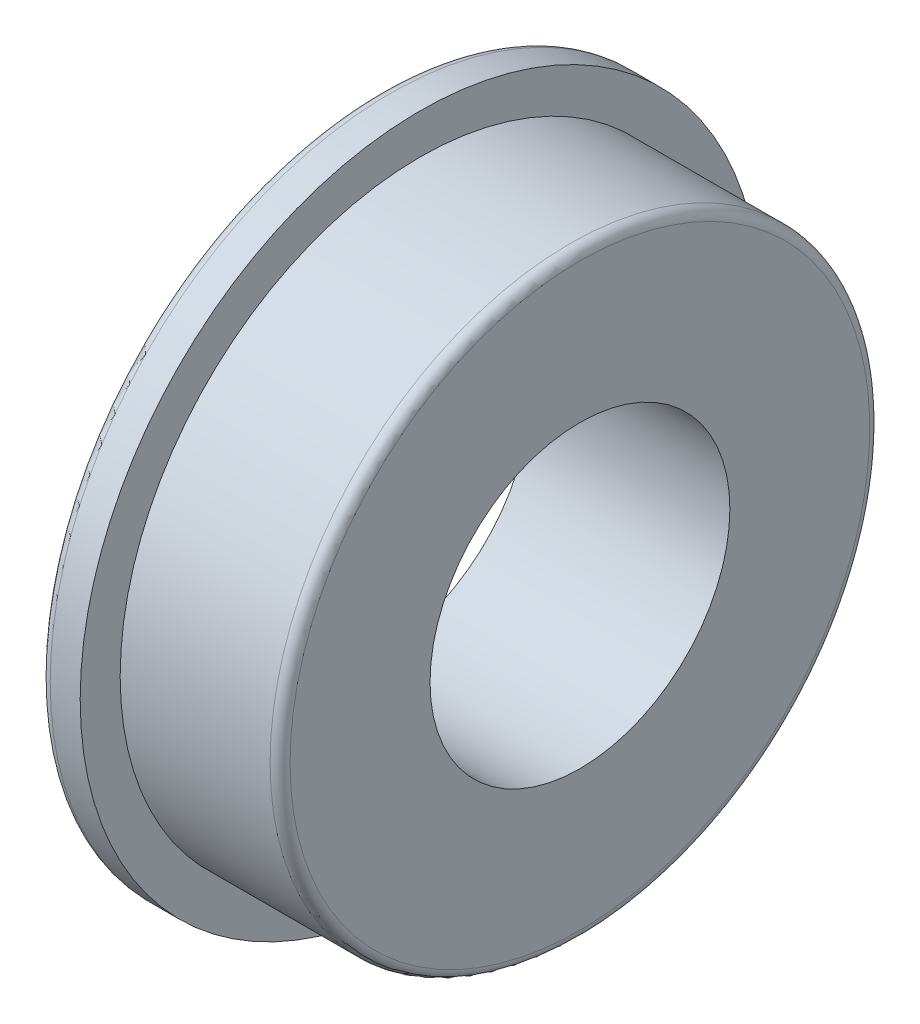
ISO-10303-21;
HEADER;
FILE_DESCRIPTION(('STEP AP214'),'2;1');
FILE_NAME('part.step','',(''),(''),'','','');
FILE_SCHEMA(('AUTOMOTIVE_DESIGN { 1 0 10303 214 1 1 1 1 }'));
ENDSEC;
DATA;
#1=APPLICATION_CONTEXT('core data for automotive mechanical design processes');
#2=APPLICATION_PROTOCOL_DEFINITION('international standard','automotive_design',2000,#1);
#3=PRODUCT_CONTEXT('',#1,'mechanical');
#4=PRODUCT('Part','Part','',(#3));
#5=PRODUCT_RELATED_PRODUCT_CATEGORY('part','',(#4));
#6=PRODUCT_DEFINITION_FORMATION('','',#4);
#7=PRODUCT_DEFINITION_CONTEXT('part definition',#1,'design');
#8=PRODUCT_DEFINITION('design','',#6,#7);
#9=PRODUCT_DEFINITION_SHAPE('','',#8);
#10=(LENGTH_UNIT() NAMED_UNIT(*) SI_UNIT(.MILLI.,.METRE.));
#11=(NAMED_UNIT(*) PLANE_ANGLE_UNIT() SI_UNIT($,.RADIAN.));
#12=(NAMED_UNIT(*) SI_UNIT($,.STERADIAN.) SOLID_ANGLE_UNIT());
#13=UNCERTAINTY_MEASURE_WITH_UNIT(LENGTH_MEASURE(1.E-05),#10,'distance_accuracy_value','');
#14=(GEOMETRIC_REPRESENTATION_CONTEXT(3) GLOBAL_UNCERTAINTY_ASSIGNED_CONTEXT((#13)) GLOBAL_UNIT_ASSIGNED_CONTEXT((#10,
#11,#12)) REPRESENTATION_CONTEXT('',''));
#15=CARTESIAN_POINT('',(0.,0.,0.));
#16=DIRECTION('',(0.,0.,1.));
#17=DIRECTION('',(1.,0.,0.));
#18=AXIS2_PLACEMENT_3D('',#15,#16,#17);
#19=CARTESIAN_POINT('',(0.,0.,0.));
#20=DIRECTION('',(-1.,0.,0.));
#21=DIRECTION('',(0.,0.,1.));
#22=AXIS2_PLACEMENT_3D('',#19,#20,#21);
#23=CYLINDRICAL_SURFACE('',#22,3.);
#24=CARTESIAN_POINT('',(4.,0.,0.));
#25=DIRECTION('',(-1.,0.,0.));
#26=DIRECTION('',(0.,0.,1.));
#27=AXIS2_PLACEMENT_3D('',#24,#25,#26);
#28=CIRCLE('',#27,3.);
#29=CARTESIAN_POINT('',(4.,0.,3.));
#30=VERTEX_POINT('',#29);
#31=EDGE_CURVE('E60',#30,#30,#28,.T.);
#32=ORIENTED_EDGE('',*,*,#31,.F.);
#33=EDGE_LOOP('',(#32));
#34=FACE_BOUND('',#33,.T.);
#35=CARTESIAN_POINT('',(0.,0.,0.));
#36=DIRECTION('',(-1.,0.,0.));
#37=DIRECTION('',(0.,0.,1.));
#38=AXIS2_PLACEMENT_3D('',#35,#36,#37);
#39=CIRCLE('',#38,3.);
#40=CARTESIAN_POINT('',(0.,0.,3.));
#41=VERTEX_POINT('',#40);
#42=EDGE_CURVE('E51',#41,#41,#39,.T.);
#43=ORIENTED_EDGE('',*,*,#42,.T.);
#44=EDGE_LOOP('',(#43));
#45=FACE_BOUND('',#44,.T.);
#46=ADVANCED_FACE('F31',(#34,#45),#23,.F.);
#47=CARTESIAN_POINT('',(0.,3.,0.));
#48=DIRECTION('',(1.,0.,0.));
#49=DIRECTION('',(0.,0.,-1.));
#50=AXIS2_PLACEMENT_3D('',#47,#48,#49);
#51=PLANE('',#50);
#52=CARTESIAN_POINT('',(0.,0.,0.));
#53=DIRECTION('',(1.,0.,0.));
#54=DIRECTION('',(0.,0.,-1.));
#55=AXIS2_PLACEMENT_3D('',#52,#53,#54);
#56=CIRCLE('',#55,6.6);
#57=CARTESIAN_POINT('',(0.,0.,-6.6));
#58=VERTEX_POINT('',#57);
#59=EDGE_CURVE('E46',#58,#58,#56,.F.);
#60=ORIENTED_EDGE('',*,*,#59,.T.);
#61=EDGE_LOOP('',(#60));
#62=FACE_BOUND('',#61,.T.);
#63=ORIENTED_EDGE('',*,*,#42,.F.);
#64=EDGE_LOOP('',(#63));
#65=FACE_BOUND('',#64,.T.);
#66=ADVANCED_FACE('F68',(#62,#65),#51,.F.);
#67=CARTESIAN_POINT('',(0.,0.,0.));
#68=DIRECTION('',(-1.,0.,0.));
#69=DIRECTION('',(0.,0.,1.));
#70=AXIS2_PLACEMENT_3D('',#67,#68,#69);
#71=CYLINDRICAL_SURFACE('',#70,6.8);
#72=CARTESIAN_POINT('',(0.2,0.,0.));
#73=DIRECTION('',(1.,0.,0.));
#74=DIRECTION('',(0.,0.,-1.));
#75=AXIS2_PLACEMENT_3D('',#72,#73,#74);
#76=CIRCLE('',#75,6.8);
#77=CARTESIAN_POINT('',(0.2,0.,-6.8));
#78=VERTEX_POINT('',#77);
#79=EDGE_CURVE('E42',#78,#78,#76,.T.);
#80=ORIENTED_EDGE('',*,*,#79,.T.);
#81=EDGE_LOOP('',(#80));
#82=FACE_BOUND('',#81,.T.);
#83=CARTESIAN_POINT('',(0.800000000000001,0.,0.));
#84=DIRECTION('',(-1.,0.,0.));
#85=DIRECTION('',(0.,0.,1.));
#86=AXIS2_PLACEMENT_3D('',#83,#84,#85);
#87=CIRCLE('',#86,6.8);
#88=CARTESIAN_POINT('',(0.800000000000001,0.,6.8));
#89=VERTEX_POINT('',#88);
#90=EDGE_CURVE('E54',#89,#89,#87,.T.);
#91=ORIENTED_EDGE('',*,*,#90,.T.);
#92=EDGE_LOOP('',(#91));
#93=FACE_BOUND('',#92,.T.);
#94=ADVANCED_FACE('F73',(#82,#93),#71,.T.);
#95=CARTESIAN_POINT('',(0.800000000000002,6.8,0.));
#96=DIRECTION('',(-1.,0.,0.));
#97=DIRECTION('',(0.,0.,1.));
#98=AXIS2_PLACEMENT_3D('',#95,#96,#97);
#99=PLANE('',#98);
#100=ORIENTED_EDGE('',*,*,#90,.F.);
#101=EDGE_LOOP('',(#100));
#102=FACE_BOUND('',#101,.T.);
#103=CARTESIAN_POINT('',(0.800000000000002,0.,0.));
#104=DIRECTION('',(-1.,0.,0.));
#105=DIRECTION('',(0.,0.,1.));
#106=AXIS2_PLACEMENT_3D('',#103,#104,#105);
#107=CIRCLE('',#106,6.);
#108=CARTESIAN_POINT('',(0.800000000000002,0.,6.));
#109=VERTEX_POINT('',#108);
#110=EDGE_CURVE('E57',#109,#109,#107,.T.);
#111=ORIENTED_EDGE('',*,*,#110,.T.);
#112=EDGE_LOOP('',(#111));
#113=FACE_BOUND('',#112,.T.);
#114=ADVANCED_FACE('F79',(#102,#113),#99,.F.);
#115=CARTESIAN_POINT('',(0.,0.,0.));
#116=DIRECTION('',(-1.,0.,0.));
#117=DIRECTION('',(0.,0.,1.));
#118=AXIS2_PLACEMENT_3D('',#115,#116,#117);
#119=CYLINDRICAL_SURFACE('',#118,6.);
#120=CARTESIAN_POINT('',(3.8,0.,0.));
#121=DIRECTION('',(-1.,0.,0.));
#122=DIRECTION('',(0.,0.,1.));
#123=AXIS2_PLACEMENT_3D('',#120,#121,#122);
#124=CIRCLE('',#123,6.);
#125=CARTESIAN_POINT('',(3.8,0.,6.));
#126=VERTEX_POINT('',#125);
#127=EDGE_CURVE('E38',#126,#126,#124,.T.);
#128=ORIENTED_EDGE('',*,*,#127,.T.);
#129=EDGE_LOOP('',(#128));
#130=FACE_BOUND('',#129,.T.);
#131=ORIENTED_EDGE('',*,*,#110,.F.);
#132=EDGE_LOOP('',(#131));
#133=FACE_BOUND('',#132,.T.);
#134=ADVANCED_FACE('F91',(#130,#133),#119,.T.);
#135=CARTESIAN_POINT('',(4.,6.,0.));
#136=DIRECTION('',(-1.,0.,0.));
#137=DIRECTION('',(0.,0.,1.));
#138=AXIS2_PLACEMENT_3D('',#135,#136,#137);
#139=PLANE('',#138);
#140=CARTESIAN_POINT('',(4.,0.,0.));
#141=DIRECTION('',(-1.,0.,0.));
#142=DIRECTION('',(0.,0.,1.));
#143=AXIS2_PLACEMENT_3D('',#140,#141,#142);
#144=CIRCLE('',#143,5.8);
#145=CARTESIAN_POINT('',(4.,0.,5.8));
#146=VERTEX_POINT('',#145);
#147=EDGE_CURVE('E10',#146,#146,#144,.F.);
#148=ORIENTED_EDGE('',*,*,#147,.T.);
#149=EDGE_LOOP('',(#148));
#150=FACE_BOUND('',#149,.T.);
#151=ORIENTED_EDGE('',*,*,#31,.T.);
#152=EDGE_LOOP('',(#151));
#153=FACE_BOUND('',#152,.T.);
#154=ADVANCED_FACE('F64',(#150,#153),#139,.F.);
#155=CARTESIAN_POINT('',(0.2,0.,0.));
#156=DIRECTION('',(1.,0.,0.));
#157=DIRECTION('',(0.,0.,-1.));
#158=AXIS2_PLACEMENT_3D('',#155,#156,#157);
#159=TOROIDAL_SURFACE('',#158,6.6,0.2);
#160=ORIENTED_EDGE('',*,*,#79,.F.);
#161=EDGE_LOOP('',(#160));
#162=FACE_BOUND('',#161,.T.);
#163=ORIENTED_EDGE('',*,*,#59,.F.);
#164=EDGE_LOOP('',(#163));
#165=FACE_BOUND('',#164,.T.);
#166=ADVANCED_FACE('F83',(#162,#165),#159,.T.);
#167=CARTESIAN_POINT('',(3.8,0.,0.));
#168=DIRECTION('',(-1.,0.,0.));
#169=DIRECTION('',(0.,0.,1.));
#170=AXIS2_PLACEMENT_3D('',#167,#168,#169);
#171=TOROIDAL_SURFACE('',#170,5.8,0.2);
#172=ORIENTED_EDGE('',*,*,#147,.F.);
#173=EDGE_LOOP('',(#172));
#174=FACE_BOUND('',#173,.T.);
#175=ORIENTED_EDGE('',*,*,#127,.F.);
#176=EDGE_LOOP('',(#175));
#177=FACE_BOUND('',#176,.T.);
#178=ADVANCED_FACE('F33',(#174,#177),#171,.T.);
#179=CLOSED_SHELL('',(#46,#66,#94,#114,#134,#154,#166,#178));
#180=MANIFOLD_SOLID_BREP('B2',#179);
#181=ADVANCED_BREP_SHAPE_REPRESENTATION('',(#18,#180),#14);
#182=SHAPE_DEFINITION_REPRESENTATION(#9,#181);
ENDSEC;
END-ISO-10303-21;
